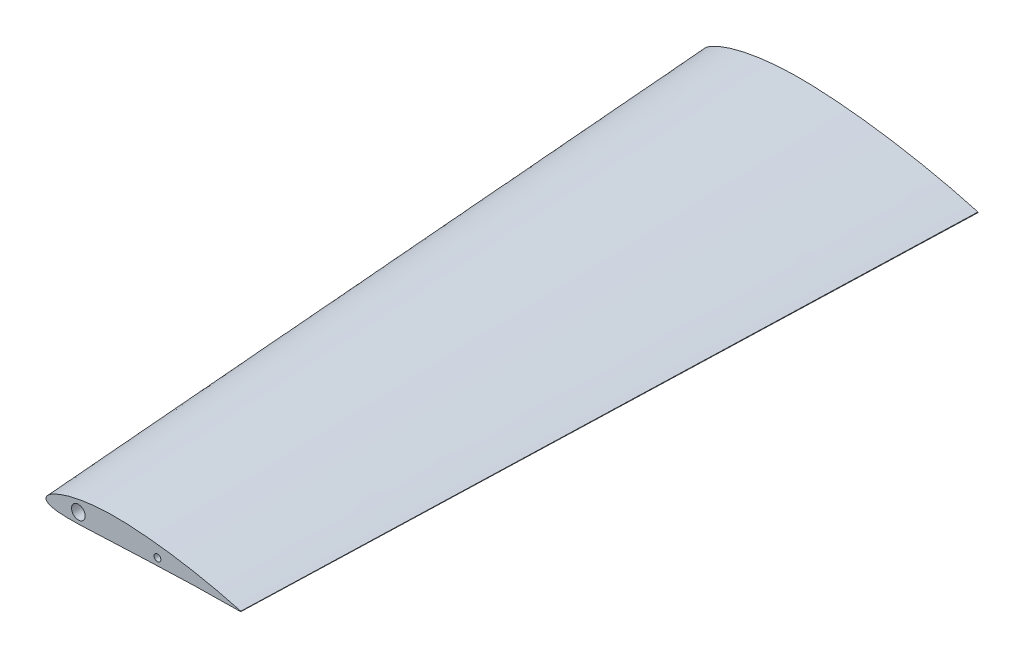
ISO-10303-21;
HEADER;
FILE_DESCRIPTION(('STEP AP214'),'2;1');
FILE_NAME('part.step','',(''),(''),'','','');
FILE_SCHEMA(('AUTOMOTIVE_DESIGN { 1 0 10303 214 1 1 1 1 }'));
ENDSEC;
DATA;
#1=APPLICATION_CONTEXT('core data for automotive mechanical design processes');
#2=APPLICATION_PROTOCOL_DEFINITION('international standard','automotive_design',2000,#1);
#3=PRODUCT_CONTEXT('',#1,'mechanical');
#4=PRODUCT('Part','Part','',(#3));
#5=PRODUCT_RELATED_PRODUCT_CATEGORY('part','',(#4));
#6=PRODUCT_DEFINITION_FORMATION('','',#4);
#7=PRODUCT_DEFINITION_CONTEXT('part definition',#1,'design');
#8=PRODUCT_DEFINITION('design','',#6,#7);
#9=PRODUCT_DEFINITION_SHAPE('','',#8);
#10=(LENGTH_UNIT() NAMED_UNIT(*) SI_UNIT(.MILLI.,.METRE.));
#11=(NAMED_UNIT(*) PLANE_ANGLE_UNIT() SI_UNIT($,.RADIAN.));
#12=(NAMED_UNIT(*) SI_UNIT($,.STERADIAN.) SOLID_ANGLE_UNIT());
#13=UNCERTAINTY_MEASURE_WITH_UNIT(LENGTH_MEASURE(1.E-05),#10,'distance_accuracy_value','');
#14=(GEOMETRIC_REPRESENTATION_CONTEXT(3) GLOBAL_UNCERTAINTY_ASSIGNED_CONTEXT((#13)) GLOBAL_UNIT_ASSIGNED_CONTEXT((#10,
#11,#12)) REPRESENTATION_CONTEXT('',''));
#15=CARTESIAN_POINT('',(0.,0.,0.));
#16=DIRECTION('',(0.,0.,1.));
#17=DIRECTION('',(1.,0.,0.));
#18=AXIS2_PLACEMENT_3D('',#15,#16,#17);
#19=CARTESIAN_POINT('',(514.435896,0.642423,0.));
#20=CARTESIAN_POINT('',(471.548210999999,0.454057999987208,1333.5));
#21=CARTESIAN_POINT('',(512.94541606473,1.05642478729432,0.));
#22=CARTESIAN_POINT('',(470.494753754272,0.746672122477082,1333.5));
#23=CARTESIAN_POINT('',(508.825527987807,2.19256313847687,0.));
#24=CARTESIAN_POINT('',(467.582858646706,1.5496815807817,1333.5));
#25=CARTESIAN_POINT('',(498.403665900981,5.01203318174744,0.));
#26=CARTESIAN_POINT('',(460.216788574629,3.54245650519408,1333.5));
#27=CARTESIAN_POINT('',(480.522495849854,9.65821949062991,0.));
#28=CARTESIAN_POINT('',(447.578553463452,6.82633180706164,1333.5));
#29=CARTESIAN_POINT('',(461.6976352898,14.2178535400194,0.));
#30=CARTESIAN_POINT('',(434.273328814241,10.0490386732759,1333.5));
#31=CARTESIAN_POINT('',(441.398480906032,18.8488091834658,0.));
#32=CARTESIAN_POINT('',(419.926087189139,13.3221532297202,1333.5));
#33=CARTESIAN_POINT('',(425.837811960539,22.2064809442018,0.));
#34=CARTESIAN_POINT('',(408.927959425464,15.6953211175711,1333.5));
#35=CARTESIAN_POINT('',(404.739444713579,26.4880124213888,0.));
#36=CARTESIAN_POINT('',(394.015842123828,18.7214664036661,1333.5));
#37=CARTESIAN_POINT('',(386.633295981129,29.9022035696143,0.));
#38=CARTESIAN_POINT('',(381.218595098486,21.1345812654302,1333.5));
#39=CARTESIAN_POINT('',(367.797715069162,33.1789779456841,0.));
#40=CARTESIAN_POINT('',(367.905792856357,23.4505740973592,1333.5));
#41=CARTESIAN_POINT('',(347.785757595347,36.4491216571071,0.));
#42=CARTESIAN_POINT('',(353.761538310277,25.7618787300853,1333.5));
#43=CARTESIAN_POINT('',(321.929657212203,40.2530036004365,0.));
#44=CARTESIAN_POINT('',(335.486701716051,28.4504232108985,1333.5));
#45=CARTESIAN_POINT('',(290.1575236074,44.1855594770424,0.));
#46=CARTESIAN_POINT('',(313.030471822044,31.2299172839469,1333.5));
#47=CARTESIAN_POINT('',(263.205160570892,46.8408013496332,0.));
#48=CARTESIAN_POINT('',(293.980807719015,33.1066147362166,1333.5));
#49=CARTESIAN_POINT('',(241.481594589181,48.5315437184497,0.));
#50=CARTESIAN_POINT('',(278.626806044593,34.3016163153823,1333.5));
#51=CARTESIAN_POINT('',(225.228952555751,49.5578635284934,0.));
#52=CARTESIAN_POINT('',(267.139599487229,35.0270082162218,1333.5));
#53=CARTESIAN_POINT('',(209.026056900066,50.3454166531266,0.));
#54=CARTESIAN_POINT('',(255.68755287874,35.5836425109885,1333.5));
#55=CARTESIAN_POINT('',(192.91849394169,50.8313771990957,0.));
#56=CARTESIAN_POINT('',(244.302886345107,35.927115011996,1333.5));
#57=CARTESIAN_POINT('',(176.973461880223,50.8910826974378,0.));
#58=CARTESIAN_POINT('',(233.03309484109,35.9693136697484,1333.5));
#59=CARTESIAN_POINT('',(156.379693514986,50.443365915704,0.));
#60=CARTESIAN_POINT('',(218.477622951542,35.6528728571563,1333.5));
#61=CARTESIAN_POINT('',(131.753417716594,48.9407852546156,0.));
#62=CARTESIAN_POINT('',(201.072014755019,34.5908623765454,1333.5));
#63=CARTESIAN_POINT('',(108.05912810278,46.1590202990312,0.));
#64=CARTESIAN_POINT('',(184.325124716788,32.6247399387227,1333.5));
#65=CARTESIAN_POINT('',(90.3059853486501,43.2428512836833,0.));
#66=CARTESIAN_POINT('',(171.777378415618,30.5636207824256,1333.5));
#67=CARTESIAN_POINT('',(77.9859974202083,40.8195537307709,0.));
#68=CARTESIAN_POINT('',(163.069732670962,28.8508575855725,1333.5));
#69=CARTESIAN_POINT('',(66.4275233836712,38.1487409922866,0.));
#70=CARTESIAN_POINT('',(154.900317065627,26.9631539946023,1333.5));
#71=CARTESIAN_POINT('',(55.6793455107768,35.2676421154893,0.));
#72=CARTESIAN_POINT('',(147.303611251825,24.9268214541628,1333.5));
#73=CARTESIAN_POINT('',(45.7858241467059,32.2152976573816,0.));
#74=CARTESIAN_POINT('',(140.310968151963,22.769453635662,1333.5));
#75=CARTESIAN_POINT('',(36.7859672757282,29.0315137261456,0.));
#76=CARTESIAN_POINT('',(133.949958304024,20.5191869488186,1333.5));
#77=CARTESIAN_POINT('',(28.7128278267648,25.7579258766505,0.));
#78=CARTESIAN_POINT('',(128.243943222938,18.2054477590111,1333.5));
#79=CARTESIAN_POINT('',(21.5951478101318,22.4321597042956,0.));
#80=CARTESIAN_POINT('',(123.213237815739,15.8548286689227,1333.5));
#81=CARTESIAN_POINT('',(15.4550025655565,19.0919579210996,0.));
#82=CARTESIAN_POINT('',(118.873443260835,13.4940076202957,1333.5));
#83=CARTESIAN_POINT('',(10.3087653268058,15.7705328063585,0.));
#84=CARTESIAN_POINT('',(115.236133633843,11.1464567811042,1333.5));
#85=CARTESIAN_POINT('',(6.16514914406117,12.4956664129553,0.));
#86=CARTESIAN_POINT('',(112.307465918484,8.83181420624795,1333.5));
#87=CARTESIAN_POINT('',(3.02641944483636,9.28349534240597,0.));
#88=CARTESIAN_POINT('',(110.08904347215,6.5614828531469,1333.5));
#89=CARTESIAN_POINT('',(0.892546496087793,6.13234383969225,0.));
#90=CARTESIAN_POINT('',(108.580843334353,4.33427994666272,1333.5));
#91=CARTESIAN_POINT('',(-0.207749289706149,3.01155653148428,0.));
#92=CARTESIAN_POINT('',(107.80316531111,2.12853842165356,1333.5));
#93=CARTESIAN_POINT('',(-0.180705806156611,-0.0362548467185213,0.));
#94=CARTESIAN_POINT('',(107.822278679744,-0.0256246268723389,1333.5));
#95=CARTESIAN_POINT('',(0.964936352383728,-2.85745424735354,0.));
#96=CARTESIAN_POINT('',(108.632008069895,-2.01962024822909,1333.5));
#97=CARTESIAN_POINT('',(3.15942728449595,-5.31808870006715,0.));
#98=CARTESIAN_POINT('',(110.183051961843,-3.75877273588915,1333.5));
#99=CARTESIAN_POINT('',(6.28988095208388,-7.43127852790095,0.));
#100=CARTESIAN_POINT('',(112.395626013006,-5.25235382542728,1333.5));
#101=CARTESIAN_POINT('',(10.3346827005672,-9.249116332702,0.));
#102=CARTESIAN_POINT('',(115.25445101078,-6.53718512599626,1333.5));
#103=CARTESIAN_POINT('',(15.2853400246204,-10.7963791421872,0.));
#104=CARTESIAN_POINT('',(118.753527326803,-7.63077372493691,1333.5));
#105=CARTESIAN_POINT('',(21.128740187722,-12.0830529684782,0.));
#106=CARTESIAN_POINT('',(122.883584864182,-8.5401822189999,1333.5));
#107=CARTESIAN_POINT('',(27.8434078851453,-13.1181164538871,0.));
#108=CARTESIAN_POINT('',(127.629445640547,-9.27175628389868,1333.5));
#109=CARTESIAN_POINT('',(35.402386955595,-13.909930601921,0.));
#110=CARTESIAN_POINT('',(132.972057337769,-9.83140097628574,1333.5));
#111=CARTESIAN_POINT('',(43.774859618114,-14.4685589897819,0.));
#112=CARTESIAN_POINT('',(138.889638054262,-10.2262353599569,1333.5));
#113=CARTESIAN_POINT('',(52.9268307234789,-14.8088115512827,0.));
#114=CARTESIAN_POINT('',(145.358160775775,-10.4667209136588,1333.5));
#115=CARTESIAN_POINT('',(62.8222991220521,-14.9425562599767,0.));
#116=CARTESIAN_POINT('',(152.352180294713,-10.5612512049219,1333.5));
#117=CARTESIAN_POINT('',(73.4230791296659,-14.8903632448912,0.));
#118=CARTESIAN_POINT('',(159.844707071525,-10.5243613303354,1333.5));
#119=CARTESIAN_POINT('',(84.6899003138328,-14.669251653047,0.));
#120=CARTESIAN_POINT('',(167.807985065512,-10.3680815224385,1333.5));
#121=CARTESIAN_POINT('',(96.5819965888191,-14.3020165903753,0.));
#122=CARTESIAN_POINT('',(176.213201295296,-10.1085245112694,1333.5));
#123=CARTESIAN_POINT('',(113.568649316398,-13.6339776986205,0.));
#124=CARTESIAN_POINT('',(188.219199631016,-9.63635992298278,1333.5));
#125=CARTESIAN_POINT('',(136.038145587383,-12.55213020457,0.));
#126=CARTESIAN_POINT('',(204.100417700833,-8.87171960345737,1333.5));
#127=CARTESIAN_POINT('',(159.255895604522,-11.3625421508041,0.));
#128=CARTESIAN_POINT('',(220.510493957693,-8.03093220714318,1333.5));
#129=CARTESIAN_POINT('',(178.63980440041,-10.426403347717,0.));
#130=CARTESIAN_POINT('',(234.210849069535,-7.36927959083769,1333.5));
#131=CARTESIAN_POINT('',(193.687789822616,-9.74571384869642,0.));
#132=CARTESIAN_POINT('',(244.846616793399,-6.88817544351863,1333.5));
#133=CARTESIAN_POINT('',(209.076975035284,-9.14665953276347,0.));
#134=CARTESIAN_POINT('',(255.72354084923,-6.4647680381547,1333.5));
#135=CARTESIAN_POINT('',(224.747841415959,-8.53645233231427,0.));
#136=CARTESIAN_POINT('',(266.799554765253,-6.03348112050647,1333.5));
#137=CARTESIAN_POINT('',(251.268043050231,-7.44592583941877,0.));
#138=CARTESIAN_POINT('',(285.543771333332,-5.26270616042734,1333.5));
#139=CARTESIAN_POINT('',(288.183310261078,-5.89213782868748,0.));
#140=CARTESIAN_POINT('',(311.635117149994,-4.16450503488361,1333.5));
#141=CARTESIAN_POINT('',(324.855252418006,-4.48957076349408,0.));
#142=CARTESIAN_POINT('',(337.554484160904,-3.17318302443308,1333.5));
#143=CARTESIAN_POINT('',(350.49312127892,-3.63029902647992,0.));
#144=CARTESIAN_POINT('',(355.67507629834,-2.56585970842198,1333.5));
#145=CARTESIAN_POINT('',(378.655916259754,-2.75217689665205,0.));
#146=CARTESIAN_POINT('',(375.580262074813,-1.94521060265128,1333.5));
#147=CARTESIAN_POINT('',(405.834971812742,-2.0685118801751,0.));
#148=CARTESIAN_POINT('',(394.790150732246,-1.4620028025464,1333.5));
#149=CARTESIAN_POINT('',(435.510495417732,-1.50653575485183,0.));
#150=CARTESIAN_POINT('',(415.764516641898,-1.06480467367074,1333.5));
#151=CARTESIAN_POINT('',(456.175948723462,-1.17512970443536,0.));
#152=CARTESIAN_POINT('',(430.370654857757,-0.830568995520572,1333.5));
#153=CARTESIAN_POINT('',(475.257418188367,-0.951341238396082,0.));
#154=CARTESIAN_POINT('',(443.857249442588,-0.672400602459617,1333.5));
#155=CARTESIAN_POINT('',(490.933297619623,-0.80445748931804,0.));
#156=CARTESIAN_POINT('',(454.936805434006,-0.568581926745332,1333.5));
#157=CARTESIAN_POINT('',(500.158698947766,-0.732541232247515,0.));
#158=CARTESIAN_POINT('',(461.457228295663,-0.517751755927463,1333.5));
#159=CARTESIAN_POINT('',(508.450560131903,-0.676259098232435,0.));
#160=CARTESIAN_POINT('',(467.317833669565,-0.477973145484204,1333.5));
#161=CARTESIAN_POINT('',(512.718654990296,-0.651738526034978,0.));
#162=CARTESIAN_POINT('',(470.334484120158,-0.460645014779035,1333.5));
#163=CARTESIAN_POINT('',(514.264104,-0.642423,0.));
#164=CARTESIAN_POINT('',(471.426788999999,-0.454058000012805,1333.5));
#165=B_SPLINE_SURFACE_WITH_KNOTS('',3,1,((#19,#20),(#21,#22),(#23,#24),(#25,#26),(#27,#28),(#29,
#30),(#31,#32),(#33,#34),(#35,#36),(#37,#38),(#39,#40),(#41,#42),(#43,#44),(#45,#46),(#47,#48),
(#49,#50),(#51,#52),(#53,#54),(#55,#56),(#57,#58),(#59,#60),(#61,#62),(#63,#64),(#65,#66),(#67,
#68),(#69,#70),(#71,#72),(#73,#74),(#75,#76),(#77,#78),(#79,#80),(#81,#82),(#83,#84),(#85,#86),
(#87,#88),(#89,#90),(#91,#92),(#93,#94),(#95,#96),(#97,#98),(#99,#100),(#101,#102),(#103,#104),
(#105,#106),(#107,#108),(#109,#110),(#111,#112),(#113,#114),(#115,#116),(#117,#118),(#119,#120),
(#121,#122),(#123,#124),(#125,#126),(#127,#128),(#129,#130),(#131,#132),(#133,#134),(#135,#136),
(#137,#138),(#139,#140),(#141,#142),(#143,#144),(#145,#146),(#147,#148),(#149,#150),(#151,#152),
(#153,#154),(#155,#156),(#157,#158),(#159,#160),(#161,#162),(#163,#164)),.UNSPECIFIED.,.F.,.F.,
.F.,(4,1,1,1,1,1,1,1,1,1,1,1,1,1,1,1,1,1,1,1,1,1,1,1,1,1,1,1,1,1,1,1,1,1,1,1,1,1,1,1,1,1,1,1,1,
1,1,1,1,1,1,1,1,1,1,1,1,1,1,1,1,1,1,1,1,1,1,1,1,1,4),(2,2),(0.,0.00440644036857422,
0.0121737299937428,0.0307541939074956,0.0570317960242728,0.0673450879951363,0.0900623576232318,
0.10237566463772,0.128668991756761,0.142544998543184,0.15683462681616,0.18642899877217,
0.216985200702991,0.248022540320765,0.263568549379391,0.27905079415257,0.294409505596858,
0.30977601328067,0.324950675699587,0.339824563938648,0.368445781112026,0.395201613054168,
0.407751474728481,0.419686063023906,0.43096195418779,0.441537442035329,0.451376775359951,
0.460447411472792,0.468722554437909,0.476182575407291,0.482814921279424,0.488618662978692,
0.493609654903146,0.497829924786717,0.501364693853581,0.504371830566402,0.507112524612496,
0.509853114307978,0.512854812617694,0.516367768618666,0.52053959257564,0.525445047045249,
0.531118392327961,0.537568297479124,0.544788289677284,0.552761790220897,0.561466342861132,
0.570873121381836,0.580950014659322,0.591662173849693,0.602972463274888,0.614840808775719,
0.640086430252391,0.667051539604885,0.681064303706584,0.695366712683046,0.709960021857495,
0.724934164323908,0.740039734181759,0.785567804764558,0.830182037591703,0.844577388167962,
0.858639375621105,0.910443941544171,0.922021682965094,0.943186534459237,0.969317876146513,
0.976379715358717,0.987841938817817,0.99559763857599,1.),(0.,1.),.UNSPECIFIED.);
#166=CARTESIAN_POINT('',(514.435896,0.642423,0.));
#167=CARTESIAN_POINT('',(512.94541606473,1.05642478729432,0.));
#168=CARTESIAN_POINT('',(508.825527987807,2.19256313847687,0.));
#169=CARTESIAN_POINT('',(498.403665900981,5.01203318174744,0.));
#170=CARTESIAN_POINT('',(480.522495849854,9.65821949062991,0.));
#171=CARTESIAN_POINT('',(461.6976352898,14.2178535400194,0.));
#172=CARTESIAN_POINT('',(441.398480906032,18.8488091834658,0.));
#173=CARTESIAN_POINT('',(425.837811960539,22.2064809442018,0.));
#174=CARTESIAN_POINT('',(404.739444713579,26.4880124213888,0.));
#175=CARTESIAN_POINT('',(386.633295981129,29.9022035696143,0.));
#176=CARTESIAN_POINT('',(367.797715069162,33.1789779456841,0.));
#177=CARTESIAN_POINT('',(347.785757595347,36.4491216571071,0.));
#178=CARTESIAN_POINT('',(321.929657212203,40.2530036004365,0.));
#179=CARTESIAN_POINT('',(290.1575236074,44.1855594770424,0.));
#180=CARTESIAN_POINT('',(263.205160570892,46.8408013496332,0.));
#181=CARTESIAN_POINT('',(241.481594589181,48.5315437184497,0.));
#182=CARTESIAN_POINT('',(225.228952555751,49.5578635284934,0.));
#183=CARTESIAN_POINT('',(209.026056900066,50.3454166531266,0.));
#184=CARTESIAN_POINT('',(192.91849394169,50.8313771990957,0.));
#185=CARTESIAN_POINT('',(176.973461880223,50.8910826974378,0.));
#186=CARTESIAN_POINT('',(156.379693514986,50.443365915704,0.));
#187=CARTESIAN_POINT('',(131.753417716594,48.9407852546156,0.));
#188=CARTESIAN_POINT('',(108.05912810278,46.1590202990312,0.));
#189=CARTESIAN_POINT('',(90.3059853486501,43.2428512836833,0.));
#190=CARTESIAN_POINT('',(77.9859974202083,40.8195537307709,0.));
#191=CARTESIAN_POINT('',(66.4275233836712,38.1487409922866,0.));
#192=CARTESIAN_POINT('',(55.6793455107768,35.2676421154893,0.));
#193=CARTESIAN_POINT('',(45.7858241467059,32.2152976573816,0.));
#194=CARTESIAN_POINT('',(36.7859672757282,29.0315137261456,0.));
#195=CARTESIAN_POINT('',(28.7128278267648,25.7579258766505,0.));
#196=CARTESIAN_POINT('',(21.5951478101318,22.4321597042956,0.));
#197=CARTESIAN_POINT('',(15.4550025655565,19.0919579210996,0.));
#198=CARTESIAN_POINT('',(10.3087653268058,15.7705328063585,0.));
#199=CARTESIAN_POINT('',(6.16514914406117,12.4956664129553,0.));
#200=CARTESIAN_POINT('',(3.02641944483636,9.28349534240597,0.));
#201=CARTESIAN_POINT('',(0.892546496087793,6.13234383969225,0.));
#202=CARTESIAN_POINT('',(-0.207749289706149,3.01155653148428,0.));
#203=CARTESIAN_POINT('',(-0.180705806156611,-0.0362548467185213,0.));
#204=CARTESIAN_POINT('',(0.964936352383728,-2.85745424735354,0.));
#205=CARTESIAN_POINT('',(3.15942728449595,-5.31808870006715,0.));
#206=CARTESIAN_POINT('',(6.28988095208388,-7.43127852790095,0.));
#207=CARTESIAN_POINT('',(10.3346827005672,-9.249116332702,0.));
#208=CARTESIAN_POINT('',(15.2853400246204,-10.7963791421872,0.));
#209=CARTESIAN_POINT('',(21.128740187722,-12.0830529684782,0.));
#210=CARTESIAN_POINT('',(27.8434078851453,-13.1181164538871,0.));
#211=CARTESIAN_POINT('',(35.402386955595,-13.909930601921,0.));
#212=CARTESIAN_POINT('',(43.774859618114,-14.4685589897819,0.));
#213=CARTESIAN_POINT('',(52.9268307234789,-14.8088115512827,0.));
#214=CARTESIAN_POINT('',(62.8222991220521,-14.9425562599767,0.));
#215=CARTESIAN_POINT('',(73.4230791296659,-14.8903632448912,0.));
#216=CARTESIAN_POINT('',(84.6899003138328,-14.669251653047,0.));
#217=CARTESIAN_POINT('',(96.5819965888191,-14.3020165903753,0.));
#218=CARTESIAN_POINT('',(113.568649316398,-13.6339776986205,0.));
#219=CARTESIAN_POINT('',(136.038145587383,-12.55213020457,0.));
#220=CARTESIAN_POINT('',(159.255895604522,-11.3625421508041,0.));
#221=CARTESIAN_POINT('',(178.63980440041,-10.426403347717,0.));
#222=CARTESIAN_POINT('',(193.687789822616,-9.74571384869642,0.));
#223=CARTESIAN_POINT('',(209.076975035284,-9.14665953276347,0.));
#224=CARTESIAN_POINT('',(224.747841415959,-8.53645233231427,0.));
#225=CARTESIAN_POINT('',(251.268043050231,-7.44592583941877,0.));
#226=CARTESIAN_POINT('',(288.183310261078,-5.89213782868748,0.));
#227=CARTESIAN_POINT('',(324.855252418006,-4.48957076349408,0.));
#228=CARTESIAN_POINT('',(350.49312127892,-3.63029902647992,0.));
#229=CARTESIAN_POINT('',(378.655916259754,-2.75217689665205,0.));
#230=CARTESIAN_POINT('',(405.834971812742,-2.0685118801751,0.));
#231=CARTESIAN_POINT('',(435.510495417732,-1.50653575485183,0.));
#232=CARTESIAN_POINT('',(456.175948723462,-1.17512970443536,0.));
#233=CARTESIAN_POINT('',(475.257418188367,-0.951341238396082,0.));
#234=CARTESIAN_POINT('',(490.933297619623,-0.80445748931804,0.));
#235=CARTESIAN_POINT('',(500.158698947766,-0.732541232247515,0.));
#236=CARTESIAN_POINT('',(508.450560131903,-0.676259098232435,0.));
#237=CARTESIAN_POINT('',(512.718654990296,-0.651738526034978,0.));
#238=CARTESIAN_POINT('',(514.264104,-0.642423,0.));
#239=B_SPLINE_CURVE_WITH_KNOTS('',3,(#166,#167,#168,#169,#170,#171,#172,#173,#174,#175,#176,
#177,#178,#179,#180,#181,#182,#183,#184,#185,#186,#187,#188,#189,#190,#191,#192,#193,#194,#195,
#196,#197,#198,#199,#200,#201,#202,#203,#204,#205,#206,#207,#208,#209,#210,#211,#212,#213,#214,
#215,#216,#217,#218,#219,#220,#221,#222,#223,#224,#225,#226,#227,#228,#229,#230,#231,#232,#233,
#234,#235,#236,#237,#238),.UNSPECIFIED.,.F.,.F.,(4,1,1,1,1,1,1,1,1,1,1,1,1,1,1,1,1,1,1,1,1,1,1,
1,1,1,1,1,1,1,1,1,1,1,1,1,1,1,1,1,1,1,1,1,1,1,1,1,1,1,1,1,1,1,1,1,1,1,1,1,1,1,1,1,1,1,1,1,1,1,
4),(0.,0.00440644036857422,0.0121737299937428,0.0307541939074956,0.0570317960242728,
0.0673450879951363,0.0900623576232318,0.10237566463772,0.128668991756761,0.142544998543184,
0.15683462681616,0.18642899877217,0.216985200702991,0.248022540320765,0.263568549379391,
0.27905079415257,0.294409505596858,0.30977601328067,0.324950675699587,0.339824563938648,
0.368445781112026,0.395201613054168,0.407751474728481,0.419686063023906,0.43096195418779,
0.441537442035329,0.451376775359951,0.460447411472792,0.468722554437909,0.476182575407291,
0.482814921279424,0.488618662978692,0.493609654903146,0.497829924786717,0.501364693853581,
0.504371830566402,0.507112524612496,0.509853114307978,0.512854812617694,0.516367768618666,
0.52053959257564,0.525445047045249,0.531118392327961,0.537568297479124,0.544788289677284,
0.552761790220897,0.561466342861132,0.570873121381836,0.580950014659322,0.591662173849693,
0.602972463274888,0.614840808775719,0.640086430252391,0.667051539604885,0.681064303706584,
0.695366712683046,0.709960021857495,0.724934164323908,0.740039734181759,0.785567804764558,
0.830182037591703,0.844577388167962,0.858639375621105,0.910443941544171,0.922021682965094,
0.943186534459237,0.969317876146513,0.976379715358717,0.987841938817817,0.99559763857599,1.),.UNSPECIFIED.);
#240=CARTESIAN_POINT('',(514.435896,0.642423,0.));
#241=VERTEX_POINT('',#240);
#242=CARTESIAN_POINT('',(514.264104,-0.642423,0.));
#243=VERTEX_POINT('',#242);
#244=EDGE_CURVE('E12',#241,#243,#239,.T.);
#245=DIRECTION('',(-0.0321074080934547,0.000141183263356079,0.999484414292092));
#246=VECTOR('',#245,1.);
#247=CARTESIAN_POINT('',(492.8454465,-0.548240500006403,666.75));
#248=LINE('',#247,#246);
#249=CARTESIAN_POINT('',(471.426788999999,-0.454058000012805,1333.5));
#250=VERTEX_POINT('',#249);
#251=EDGE_CURVE('E85',#243,#250,#248,.T.);
#252=CARTESIAN_POINT('',(471.548210999999,0.454057999987208,1333.5));
#253=CARTESIAN_POINT('',(470.494753754272,0.746672122477082,1333.5));
#254=CARTESIAN_POINT('',(467.582858646706,1.5496815807817,1333.5));
#255=CARTESIAN_POINT('',(460.216788574629,3.54245650519408,1333.5));
#256=CARTESIAN_POINT('',(447.578553463452,6.82633180706164,1333.5));
#257=CARTESIAN_POINT('',(434.273328814241,10.0490386732759,1333.5));
#258=CARTESIAN_POINT('',(419.926087189139,13.3221532297202,1333.5));
#259=CARTESIAN_POINT('',(408.927959425464,15.6953211175711,1333.5));
#260=CARTESIAN_POINT('',(394.015842123828,18.7214664036661,1333.5));
#261=CARTESIAN_POINT('',(381.218595098486,21.1345812654302,1333.5));
#262=CARTESIAN_POINT('',(367.905792856357,23.4505740973592,1333.5));
#263=CARTESIAN_POINT('',(353.761538310277,25.7618787300853,1333.5));
#264=CARTESIAN_POINT('',(335.486701716051,28.4504232108985,1333.5));
#265=CARTESIAN_POINT('',(313.030471822044,31.2299172839469,1333.5));
#266=CARTESIAN_POINT('',(293.980807719015,33.1066147362166,1333.5));
#267=CARTESIAN_POINT('',(278.626806044593,34.3016163153823,1333.5));
#268=CARTESIAN_POINT('',(267.139599487229,35.0270082162218,1333.5));
#269=CARTESIAN_POINT('',(255.68755287874,35.5836425109885,1333.5));
#270=CARTESIAN_POINT('',(244.302886345107,35.927115011996,1333.5));
#271=CARTESIAN_POINT('',(233.03309484109,35.9693136697484,1333.5));
#272=CARTESIAN_POINT('',(218.477622951542,35.6528728571563,1333.5));
#273=CARTESIAN_POINT('',(201.072014755019,34.5908623765454,1333.5));
#274=CARTESIAN_POINT('',(184.325124716788,32.6247399387227,1333.5));
#275=CARTESIAN_POINT('',(171.777378415618,30.5636207824256,1333.5));
#276=CARTESIAN_POINT('',(163.069732670962,28.8508575855725,1333.5));
#277=CARTESIAN_POINT('',(154.900317065627,26.9631539946023,1333.5));
#278=CARTESIAN_POINT('',(147.303611251825,24.9268214541628,1333.5));
#279=CARTESIAN_POINT('',(140.310968151963,22.769453635662,1333.5));
#280=CARTESIAN_POINT('',(133.949958304024,20.5191869488186,1333.5));
#281=CARTESIAN_POINT('',(128.243943222938,18.2054477590111,1333.5));
#282=CARTESIAN_POINT('',(123.213237815739,15.8548286689227,1333.5));
#283=CARTESIAN_POINT('',(118.873443260835,13.4940076202957,1333.5));
#284=CARTESIAN_POINT('',(115.236133633843,11.1464567811042,1333.5));
#285=CARTESIAN_POINT('',(112.307465918484,8.83181420624795,1333.5));
#286=CARTESIAN_POINT('',(110.08904347215,6.5614828531469,1333.5));
#287=CARTESIAN_POINT('',(108.580843334353,4.33427994666272,1333.5));
#288=CARTESIAN_POINT('',(107.80316531111,2.12853842165356,1333.5));
#289=CARTESIAN_POINT('',(107.822278679744,-0.0256246268723389,1333.5));
#290=CARTESIAN_POINT('',(108.632008069895,-2.01962024822909,1333.5));
#291=CARTESIAN_POINT('',(110.183051961843,-3.75877273588915,1333.5));
#292=CARTESIAN_POINT('',(112.395626013006,-5.25235382542728,1333.5));
#293=CARTESIAN_POINT('',(115.25445101078,-6.53718512599626,1333.5));
#294=CARTESIAN_POINT('',(118.753527326803,-7.63077372493691,1333.5));
#295=CARTESIAN_POINT('',(122.883584864182,-8.5401822189999,1333.5));
#296=CARTESIAN_POINT('',(127.629445640547,-9.27175628389868,1333.5));
#297=CARTESIAN_POINT('',(132.972057337769,-9.83140097628574,1333.5));
#298=CARTESIAN_POINT('',(138.889638054262,-10.2262353599569,1333.5));
#299=CARTESIAN_POINT('',(145.358160775775,-10.4667209136588,1333.5));
#300=CARTESIAN_POINT('',(152.352180294713,-10.5612512049219,1333.5));
#301=CARTESIAN_POINT('',(159.844707071525,-10.5243613303354,1333.5));
#302=CARTESIAN_POINT('',(167.807985065512,-10.3680815224385,1333.5));
#303=CARTESIAN_POINT('',(176.213201295296,-10.1085245112694,1333.5));
#304=CARTESIAN_POINT('',(188.219199631016,-9.63635992298278,1333.5));
#305=CARTESIAN_POINT('',(204.100417700833,-8.87171960345737,1333.5));
#306=CARTESIAN_POINT('',(220.510493957693,-8.03093220714318,1333.5));
#307=CARTESIAN_POINT('',(234.210849069535,-7.36927959083769,1333.5));
#308=CARTESIAN_POINT('',(244.846616793399,-6.88817544351863,1333.5));
#309=CARTESIAN_POINT('',(255.72354084923,-6.4647680381547,1333.5));
#310=CARTESIAN_POINT('',(266.799554765253,-6.03348112050647,1333.5));
#311=CARTESIAN_POINT('',(285.543771333332,-5.26270616042734,1333.5));
#312=CARTESIAN_POINT('',(311.635117149994,-4.16450503488361,1333.5));
#313=CARTESIAN_POINT('',(337.554484160904,-3.17318302443308,1333.5));
#314=CARTESIAN_POINT('',(355.67507629834,-2.56585970842198,1333.5));
#315=CARTESIAN_POINT('',(375.580262074813,-1.94521060265128,1333.5));
#316=CARTESIAN_POINT('',(394.790150732246,-1.4620028025464,1333.5));
#317=CARTESIAN_POINT('',(415.764516641898,-1.06480467367074,1333.5));
#318=CARTESIAN_POINT('',(430.370654857757,-0.830568995520572,1333.5));
#319=CARTESIAN_POINT('',(443.857249442588,-0.672400602459617,1333.5));
#320=CARTESIAN_POINT('',(454.936805434006,-0.568581926745332,1333.5));
#321=CARTESIAN_POINT('',(461.457228295663,-0.517751755927463,1333.5));
#322=CARTESIAN_POINT('',(467.317833669565,-0.477973145484204,1333.5));
#323=CARTESIAN_POINT('',(470.334484120158,-0.460645014779035,1333.5));
#324=CARTESIAN_POINT('',(471.426788999999,-0.454058000012805,1333.5));
#325=B_SPLINE_CURVE_WITH_KNOTS('',3,(#252,#253,#254,#255,#256,#257,#258,#259,#260,#261,#262,
#263,#264,#265,#266,#267,#268,#269,#270,#271,#272,#273,#274,#275,#276,#277,#278,#279,#280,#281,
#282,#283,#284,#285,#286,#287,#288,#289,#290,#291,#292,#293,#294,#295,#296,#297,#298,#299,#300,
#301,#302,#303,#304,#305,#306,#307,#308,#309,#310,#311,#312,#313,#314,#315,#316,#317,#318,#319,
#320,#321,#322,#323,#324),.UNSPECIFIED.,.F.,.F.,(4,1,1,1,1,1,1,1,1,1,1,1,1,1,1,1,1,1,1,1,1,1,1,
1,1,1,1,1,1,1,1,1,1,1,1,1,1,1,1,1,1,1,1,1,1,1,1,1,1,1,1,1,1,1,1,1,1,1,1,1,1,1,1,1,1,1,1,1,1,1,
4),(0.,0.00440644036857422,0.0121737299937428,0.0307541939074956,0.0570317960242728,
0.0673450879951363,0.0900623576232318,0.10237566463772,0.128668991756761,0.142544998543184,
0.15683462681616,0.18642899877217,0.216985200702991,0.248022540320765,0.263568549379391,
0.27905079415257,0.294409505596858,0.30977601328067,0.324950675699587,0.339824563938648,
0.368445781112026,0.395201613054168,0.407751474728481,0.419686063023906,0.43096195418779,
0.441537442035329,0.451376775359951,0.460447411472792,0.468722554437909,0.476182575407291,
0.482814921279424,0.488618662978692,0.493609654903146,0.497829924786717,0.501364693853581,
0.504371830566402,0.507112524612496,0.509853114307978,0.512854812617694,0.516367768618666,
0.52053959257564,0.525445047045249,0.531118392327961,0.537568297479124,0.544788289677284,
0.552761790220897,0.561466342861132,0.570873121381836,0.580950014659322,0.591662173849693,
0.602972463274888,0.614840808775719,0.640086430252391,0.667051539604885,0.681064303706584,
0.695366712683046,0.709960021857495,0.724934164323908,0.740039734181759,0.785567804764558,
0.830182037591703,0.844577388167962,0.858639375621105,0.910443941544171,0.922021682965094,
0.943186534459237,0.969317876146513,0.976379715358717,0.987841938817817,0.99559763857599,1.),.UNSPECIFIED.);
#326=CARTESIAN_POINT('',(471.548210999999,0.454057999987208,1333.5));
#327=VERTEX_POINT('',#326);
#328=EDGE_CURVE('E201',#327,#250,#325,.T.);
#329=DIRECTION('',(-0.0321451224088134,-0.000141183092138155,0.999483202046266));
#330=VECTOR('',#329,1.);
#331=CARTESIAN_POINT('',(492.992053499999,0.548240499993604,666.75));
#332=LINE('',#331,#330);
#333=EDGE_CURVE('E209',#241,#327,#332,.T.);
#334=ORIENTED_EDGE('',*,*,#244,.T.);
#335=ORIENTED_EDGE('',*,*,#251,.T.);
#336=ORIENTED_EDGE('',*,*,#328,.F.);
#337=ORIENTED_EDGE('',*,*,#333,.F.);
#338=EDGE_LOOP('',(#334,#335,#336,#337));
#339=FACE_BOUND('',#338,.T.);
#340=ADVANCED_FACE('F75',(#339),#165,.T.);
#341=CARTESIAN_POINT('',(514.264104,-0.642423,0.));
#342=DIRECTION('',(0.990676755749762,-0.132459719860366,0.0318431818705373));
#343=DIRECTION('',(0.132526927273884,0.991179405328492,0.));
#344=AXIS2_PLACEMENT_3D('',#341,#342,#343);
#345=PLANE('',#344);
#346=DIRECTION('',(0.132526927273884,0.991179405328492,0.));
#347=VECTOR('',#346,1.);
#348=CARTESIAN_POINT('',(514.35,0.,0.));
#349=LINE('',#348,#347);
#350=EDGE_CURVE('E101',#243,#241,#349,.T.);
#351=ORIENTED_EDGE('',*,*,#350,.T.);
#352=ORIENTED_EDGE('',*,*,#333,.T.);
#353=DIRECTION('',(0.132528185092149,0.991179237149458,0.));
#354=VECTOR('',#353,1.);
#355=CARTESIAN_POINT('',(471.487499999999,-1.27985729653224E-11,1333.5));
#356=LINE('',#355,#354);
#357=EDGE_CURVE('E111',#250,#327,#356,.T.);
#358=ORIENTED_EDGE('',*,*,#357,.F.);
#359=ORIENTED_EDGE('',*,*,#251,.F.);
#360=EDGE_LOOP('',(#351,#352,#358,#359));
#361=FACE_BOUND('',#360,.T.);
#362=ADVANCED_FACE('F77',(#361),#345,.T.);
#363=CARTESIAN_POINT('',(1.63937416751884,7.1536347015875,0.));
#364=DIRECTION('',(0.,0.,-1.));
#365=DIRECTION('',(-1.,0.,0.));
#366=AXIS2_PLACEMENT_3D('',#363,#364,#365);
#367=PLANE('',#366);
#368=DIRECTION('',(0.,1.,0.));
#369=VECTOR('',#368,1.);
#370=CARTESIAN_POINT('',(187.325,7.42529091692438,0.));
#371=LINE('',#370,#369);
#372=CARTESIAN_POINT('',(187.325,7.42529091692438,0.));
#373=VERTEX_POINT('',#372);
#374=CARTESIAN_POINT('',(187.325,10.6002909169244,0.));
#375=VERTEX_POINT('',#374);
#376=EDGE_CURVE('E93',#373,#375,#371,.T.);
#377=ORIENTED_EDGE('',*,*,#376,.F.);
#378=DIRECTION('',(-1.,0.,0.));
#379=VECTOR('',#378,1.);
#380=CARTESIAN_POINT('',(288.925,7.4252909169244,0.));
#381=LINE('',#380,#379);
#382=CARTESIAN_POINT('',(288.925,7.4252909169244,0.));
#383=VERTEX_POINT('',#382);
#384=EDGE_CURVE('E170',#383,#373,#381,.T.);
#385=ORIENTED_EDGE('',*,*,#384,.F.);
#386=DIRECTION('',(0.,-1.,0.));
#387=VECTOR('',#386,1.);
#388=CARTESIAN_POINT('',(288.925,10.6002909169244,0.));
#389=LINE('',#388,#387);
#390=CARTESIAN_POINT('',(288.925,10.6002909169244,0.));
#391=VERTEX_POINT('',#390);
#392=EDGE_CURVE('E179',#391,#383,#389,.T.);
#393=ORIENTED_EDGE('',*,*,#392,.F.);
#394=DIRECTION('',(1.,0.,0.));
#395=VECTOR('',#394,1.);
#396=CARTESIAN_POINT('',(187.325,10.6002909169244,0.));
#397=LINE('',#396,#395);
#398=EDGE_CURVE('E150',#375,#391,#397,.T.);
#399=ORIENTED_EDGE('',*,*,#398,.F.);
#400=EDGE_LOOP('',(#377,#385,#393,#399));
#401=FACE_BOUND('',#400,.T.);
#402=CARTESIAN_POINT('',(168.275,9.01279091692438,0.));
#403=DIRECTION('',(0.,0.,-1.));
#404=DIRECTION('',(-1.,0.,0.));
#405=AXIS2_PLACEMENT_3D('',#402,#403,#404);
#406=CIRCLE('',#405,12.7);
#407=CARTESIAN_POINT('',(155.575,9.01279091692438,0.));
#408=VERTEX_POINT('',#407);
#409=EDGE_CURVE('E191',#408,#408,#406,.T.);
#410=ORIENTED_EDGE('',*,*,#409,.F.);
#411=EDGE_LOOP('',(#410));
#412=FACE_BOUND('',#411,.T.);
#413=CARTESIAN_POINT('',(315.9125,9.01279091692439,0.));
#414=DIRECTION('',(0.,0.,-1.));
#415=DIRECTION('',(-1.,0.,0.));
#416=AXIS2_PLACEMENT_3D('',#413,#414,#415);
#417=CIRCLE('',#416,6.35);
#418=CARTESIAN_POINT('',(309.5625,9.01279091692439,0.));
#419=VERTEX_POINT('',#418);
#420=EDGE_CURVE('E186',#419,#419,#417,.T.);
#421=ORIENTED_EDGE('',*,*,#420,.F.);
#422=EDGE_LOOP('',(#421));
#423=FACE_BOUND('',#422,.T.);
#424=ORIENTED_EDGE('',*,*,#350,.F.);
#425=ORIENTED_EDGE('',*,*,#244,.F.);
#426=EDGE_LOOP('',(#424,#425));
#427=FACE_BOUND('',#426,.T.);
#428=ADVANCED_FACE('F252',(#401,#412,#423,#427),#367,.T.);
#429=CARTESIAN_POINT('',(109.108694028689,5.05611885414467,1333.5));
#430=DIRECTION('',(0.,0.,-1.));
#431=DIRECTION('',(-1.,0.,0.));
#432=AXIS2_PLACEMENT_3D('',#429,#430,#431);
#433=PLANE('',#432);
#434=CARTESIAN_POINT('',(168.275,9.01279091692438,1333.5));
#435=DIRECTION('',(0.,0.,-1.));
#436=DIRECTION('',(-1.,0.,0.));
#437=AXIS2_PLACEMENT_3D('',#434,#435,#436);
#438=CIRCLE('',#437,12.7);
#439=CARTESIAN_POINT('',(155.575,9.01279091692438,1333.5));
#440=VERTEX_POINT('',#439);
#441=EDGE_CURVE('E79',#440,#440,#438,.T.);
#442=ORIENTED_EDGE('',*,*,#441,.T.);
#443=EDGE_LOOP('',(#442));
#444=FACE_BOUND('',#443,.T.);
#445=CARTESIAN_POINT('',(315.9125,9.01279091692439,1333.5));
#446=DIRECTION('',(0.,0.,-1.));
#447=DIRECTION('',(-1.,0.,0.));
#448=AXIS2_PLACEMENT_3D('',#445,#446,#447);
#449=CIRCLE('',#448,6.35);
#450=CARTESIAN_POINT('',(309.5625,9.01279091692439,1333.5));
#451=VERTEX_POINT('',#450);
#452=EDGE_CURVE('E195',#451,#451,#449,.T.);
#453=ORIENTED_EDGE('',*,*,#452,.T.);
#454=EDGE_LOOP('',(#453));
#455=FACE_BOUND('',#454,.T.);
#456=ORIENTED_EDGE('',*,*,#328,.T.);
#457=ORIENTED_EDGE('',*,*,#357,.T.);
#458=EDGE_LOOP('',(#456,#457));
#459=FACE_BOUND('',#458,.T.);
#460=ADVANCED_FACE('F229',(#444,#455,#459),#433,.F.);
#461=CARTESIAN_POINT('',(315.9125,9.01279091692439,1434.));
#462=DIRECTION('',(0.,0.,-1.));
#463=DIRECTION('',(-1.,0.,0.));
#464=AXIS2_PLACEMENT_3D('',#461,#462,#463);
#465=CYLINDRICAL_SURFACE('',#464,6.35);
#466=ORIENTED_EDGE('',*,*,#420,.T.);
#467=EDGE_LOOP('',(#466));
#468=FACE_BOUND('',#467,.T.);
#469=ORIENTED_EDGE('',*,*,#452,.F.);
#470=EDGE_LOOP('',(#469));
#471=FACE_BOUND('',#470,.T.);
#472=ADVANCED_FACE('F234',(#468,#471),#465,.F.);
#473=CARTESIAN_POINT('',(168.275,9.01279091692438,1434.));
#474=DIRECTION('',(0.,0.,-1.));
#475=DIRECTION('',(-1.,0.,0.));
#476=AXIS2_PLACEMENT_3D('',#473,#474,#475);
#477=CYLINDRICAL_SURFACE('',#476,12.7);
#478=ORIENTED_EDGE('',*,*,#409,.T.);
#479=EDGE_LOOP('',(#478));
#480=FACE_BOUND('',#479,.T.);
#481=ORIENTED_EDGE('',*,*,#441,.F.);
#482=EDGE_LOOP('',(#481));
#483=FACE_BOUND('',#482,.T.);
#484=ADVANCED_FACE('F231',(#480,#483),#477,.F.);
#485=CARTESIAN_POINT('',(187.325,7.42529091692438,152.4));
#486=DIRECTION('',(-1.,0.,0.));
#487=DIRECTION('',(0.,0.,1.));
#488=AXIS2_PLACEMENT_3D('',#485,#486,#487);
#489=PLANE('',#488);
#490=ORIENTED_EDGE('',*,*,#376,.T.);
#491=DIRECTION('',(0.,0.,-1.));
#492=VECTOR('',#491,1.);
#493=CARTESIAN_POINT('',(187.325,10.6002909169244,152.4));
#494=LINE('',#493,#492);
#495=CARTESIAN_POINT('',(187.325,10.6002909169244,152.4));
#496=VERTEX_POINT('',#495);
#497=EDGE_CURVE('E138',#496,#375,#494,.T.);
#498=ORIENTED_EDGE('',*,*,#497,.F.);
#499=DIRECTION('',(0.,1.,0.));
#500=VECTOR('',#499,1.);
#501=CARTESIAN_POINT('',(187.325,7.42529091692438,152.4));
#502=LINE('',#501,#500);
#503=CARTESIAN_POINT('',(187.325,7.42529091692438,152.4));
#504=VERTEX_POINT('',#503);
#505=EDGE_CURVE('E166',#504,#496,#502,.T.);
#506=ORIENTED_EDGE('',*,*,#505,.F.);
#507=DIRECTION('',(0.,0.,-1.));
#508=VECTOR('',#507,1.);
#509=CARTESIAN_POINT('',(187.325,7.42529091692438,152.4));
#510=LINE('',#509,#508);
#511=EDGE_CURVE('E123',#504,#373,#510,.T.);
#512=ORIENTED_EDGE('',*,*,#511,.T.);
#513=EDGE_LOOP('',(#490,#498,#506,#512));
#514=FACE_BOUND('',#513,.T.);
#515=ADVANCED_FACE('F233',(#514),#489,.F.);
#516=CARTESIAN_POINT('',(288.925,7.4252909169244,152.4));
#517=DIRECTION('',(0.,-1.,0.));
#518=DIRECTION('',(1.,0.,0.));
#519=AXIS2_PLACEMENT_3D('',#516,#517,#518);
#520=PLANE('',#519);
#521=ORIENTED_EDGE('',*,*,#384,.T.);
#522=ORIENTED_EDGE('',*,*,#511,.F.);
#523=DIRECTION('',(-1.,0.,0.));
#524=VECTOR('',#523,1.);
#525=CARTESIAN_POINT('',(288.925,7.4252909169244,152.4));
#526=LINE('',#525,#524);
#527=CARTESIAN_POINT('',(288.925,7.4252909169244,152.4));
#528=VERTEX_POINT('',#527);
#529=EDGE_CURVE('E163',#528,#504,#526,.T.);
#530=ORIENTED_EDGE('',*,*,#529,.F.);
#531=DIRECTION('',(0.,0.,-1.));
#532=VECTOR('',#531,1.);
#533=CARTESIAN_POINT('',(288.925,7.4252909169244,152.4));
#534=LINE('',#533,#532);
#535=EDGE_CURVE('E155',#528,#383,#534,.T.);
#536=ORIENTED_EDGE('',*,*,#535,.T.);
#537=EDGE_LOOP('',(#521,#522,#530,#536));
#538=FACE_BOUND('',#537,.T.);
#539=ADVANCED_FACE('F242',(#538),#520,.F.);
#540=CARTESIAN_POINT('',(288.925,10.6002909169244,152.4));
#541=DIRECTION('',(1.,0.,0.));
#542=DIRECTION('',(0.,0.,-1.));
#543=AXIS2_PLACEMENT_3D('',#540,#541,#542);
#544=PLANE('',#543);
#545=ORIENTED_EDGE('',*,*,#392,.T.);
#546=ORIENTED_EDGE('',*,*,#535,.F.);
#547=DIRECTION('',(0.,-1.,0.));
#548=VECTOR('',#547,1.);
#549=CARTESIAN_POINT('',(288.925,10.6002909169244,152.4));
#550=LINE('',#549,#548);
#551=CARTESIAN_POINT('',(288.925,10.6002909169244,152.4));
#552=VERTEX_POINT('',#551);
#553=EDGE_CURVE('E158',#552,#528,#550,.T.);
#554=ORIENTED_EDGE('',*,*,#553,.F.);
#555=DIRECTION('',(0.,0.,-1.));
#556=VECTOR('',#555,1.);
#557=CARTESIAN_POINT('',(288.925,10.6002909169244,152.4));
#558=LINE('',#557,#556);
#559=EDGE_CURVE('E143',#552,#391,#558,.T.);
#560=ORIENTED_EDGE('',*,*,#559,.T.);
#561=EDGE_LOOP('',(#545,#546,#554,#560));
#562=FACE_BOUND('',#561,.T.);
#563=ADVANCED_FACE('F159',(#562),#544,.F.);
#564=CARTESIAN_POINT('',(187.325,10.6002909169244,152.4));
#565=DIRECTION('',(0.,1.,0.));
#566=DIRECTION('',(0.,0.,1.));
#567=AXIS2_PLACEMENT_3D('',#564,#565,#566);
#568=PLANE('',#567);
#569=ORIENTED_EDGE('',*,*,#398,.T.);
#570=ORIENTED_EDGE('',*,*,#559,.F.);
#571=DIRECTION('',(1.,0.,0.));
#572=VECTOR('',#571,1.);
#573=CARTESIAN_POINT('',(187.325,10.6002909169244,152.4));
#574=LINE('',#573,#572);
#575=EDGE_CURVE('E147',#496,#552,#574,.T.);
#576=ORIENTED_EDGE('',*,*,#575,.F.);
#577=ORIENTED_EDGE('',*,*,#497,.T.);
#578=EDGE_LOOP('',(#569,#570,#576,#577));
#579=FACE_BOUND('',#578,.T.);
#580=ADVANCED_FACE('F145',(#579),#568,.F.);
#581=CARTESIAN_POINT('',(0.,0.,152.4));
#582=DIRECTION('',(0.,0.,-1.));
#583=DIRECTION('',(-1.,0.,0.));
#584=AXIS2_PLACEMENT_3D('',#581,#582,#583);
#585=PLANE('',#584);
#586=ORIENTED_EDGE('',*,*,#505,.T.);
#587=ORIENTED_EDGE('',*,*,#575,.T.);
#588=ORIENTED_EDGE('',*,*,#553,.T.);
#589=ORIENTED_EDGE('',*,*,#529,.T.);
#590=EDGE_LOOP('',(#586,#587,#588,#589));
#591=FACE_BOUND('',#590,.T.);
#592=ADVANCED_FACE('F165',(#591),#585,.T.);
#593=CLOSED_SHELL('',(#340,#362,#428,#460,#472,#484,#515,#539,#563,#580,#592));
#594=MANIFOLD_SOLID_BREP('B2',#593);
#595=ADVANCED_BREP_SHAPE_REPRESENTATION('',(#18,#594),#14);
#596=SHAPE_DEFINITION_REPRESENTATION(#9,#595);
ENDSEC;
END-ISO-10303-21;
